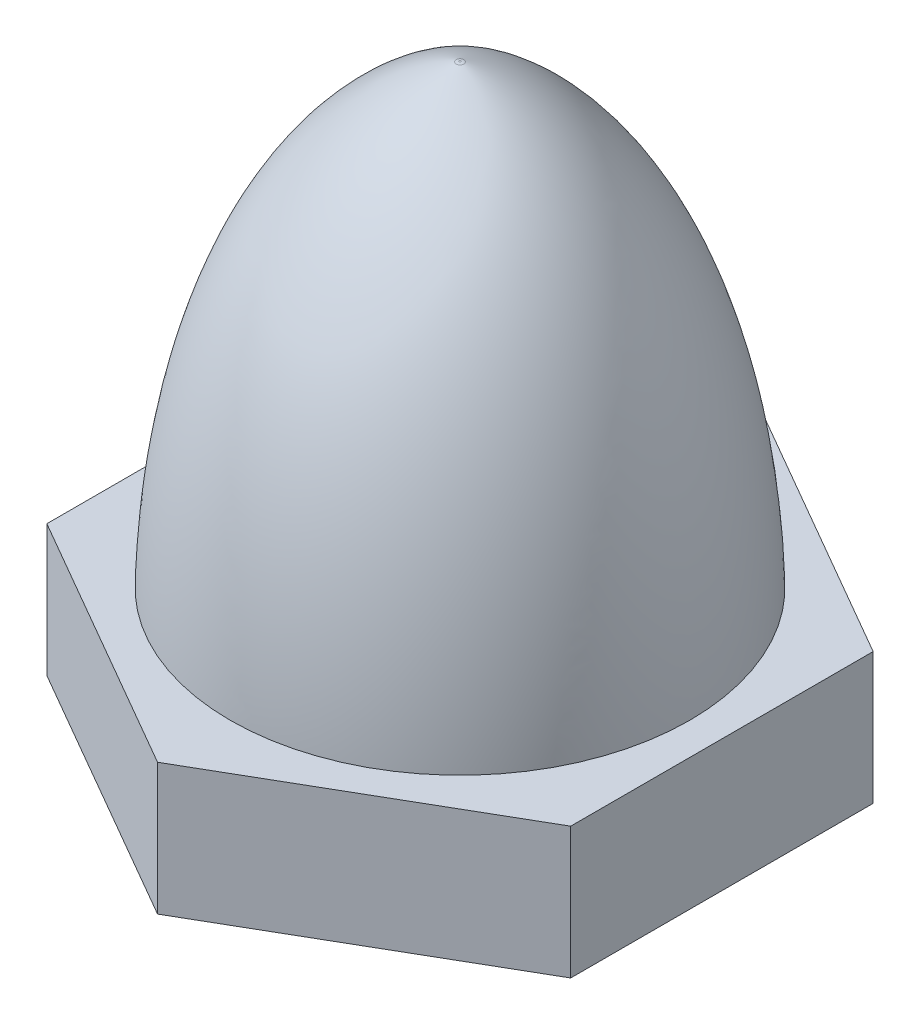
ISO-10303-21;
HEADER;
FILE_DESCRIPTION(('STEP AP214'),'2;1');
FILE_NAME('part.step','',(''),(''),'','','');
FILE_SCHEMA(('AUTOMOTIVE_DESIGN { 1 0 10303 214 1 1 1 1 }'));
ENDSEC;
DATA;
#1=APPLICATION_CONTEXT('core data for automotive mechanical design processes');
#2=APPLICATION_PROTOCOL_DEFINITION('international standard','automotive_design',2000,#1);
#3=PRODUCT_CONTEXT('',#1,'mechanical');
#4=PRODUCT('Part','Part','',(#3));
#5=PRODUCT_RELATED_PRODUCT_CATEGORY('part','',(#4));
#6=PRODUCT_DEFINITION_FORMATION('','',#4);
#7=PRODUCT_DEFINITION_CONTEXT('part definition',#1,'design');
#8=PRODUCT_DEFINITION('design','',#6,#7);
#9=PRODUCT_DEFINITION_SHAPE('','',#8);
#10=(LENGTH_UNIT() NAMED_UNIT(*) SI_UNIT(.MILLI.,.METRE.));
#11=(NAMED_UNIT(*) PLANE_ANGLE_UNIT() SI_UNIT($,.RADIAN.));
#12=(NAMED_UNIT(*) SI_UNIT($,.STERADIAN.) SOLID_ANGLE_UNIT());
#13=UNCERTAINTY_MEASURE_WITH_UNIT(LENGTH_MEASURE(1.E-05),#10,'distance_accuracy_value','');
#14=(GEOMETRIC_REPRESENTATION_CONTEXT(3) GLOBAL_UNCERTAINTY_ASSIGNED_CONTEXT((#13)) GLOBAL_UNIT_ASSIGNED_CONTEXT((#10,
#11,#12)) REPRESENTATION_CONTEXT('',''));
#15=CARTESIAN_POINT('',(0.,0.,0.));
#16=DIRECTION('',(0.,0.,1.));
#17=DIRECTION('',(1.,0.,0.));
#18=AXIS2_PLACEMENT_3D('',#15,#16,#17);
#19=CARTESIAN_POINT('',(-5.97557528611263,3.,3.45));
#20=DIRECTION('',(0.5,0.,-0.866025403784439));
#21=DIRECTION('',(-0.866025403784439,0.,-0.5));
#22=AXIS2_PLACEMENT_3D('',#19,#20,#21);
#23=PLANE('',#22);
#24=DIRECTION('',(0.866025403784439,0.,0.5));
#25=VECTOR('',#24,1.);
#26=CARTESIAN_POINT('',(-5.97557528611263,0.,3.45));
#27=LINE('',#26,#25);
#28=CARTESIAN_POINT('',(-5.97557528611263,0.,3.45));
#29=VERTEX_POINT('',#28);
#30=CARTESIAN_POINT('',(0.,0.,6.9));
#31=VERTEX_POINT('',#30);
#32=EDGE_CURVE('E126',#29,#31,#27,.T.);
#33=ORIENTED_EDGE('',*,*,#32,.T.);
#34=DIRECTION('',(0.,-1.,0.));
#35=VECTOR('',#34,1.);
#36=CARTESIAN_POINT('',(0.,3.,6.9));
#37=LINE('',#36,#35);
#38=CARTESIAN_POINT('',(0.,3.,6.9));
#39=VERTEX_POINT('',#38);
#40=EDGE_CURVE('E144',#39,#31,#37,.T.);
#41=ORIENTED_EDGE('',*,*,#40,.F.);
#42=DIRECTION('',(0.866025403784439,0.,0.5));
#43=VECTOR('',#42,1.);
#44=CARTESIAN_POINT('',(-5.97557528611263,3.,3.45));
#45=LINE('',#44,#43);
#46=CARTESIAN_POINT('',(-5.97557528611263,3.,3.45));
#47=VERTEX_POINT('',#46);
#48=EDGE_CURVE('E137',#47,#39,#45,.T.);
#49=ORIENTED_EDGE('',*,*,#48,.F.);
#50=DIRECTION('',(0.,-1.,0.));
#51=VECTOR('',#50,1.);
#52=CARTESIAN_POINT('',(-5.97557528611263,3.,3.45));
#53=LINE('',#52,#51);
#54=EDGE_CURVE('E122',#47,#29,#53,.T.);
#55=ORIENTED_EDGE('',*,*,#54,.T.);
#56=EDGE_LOOP('',(#33,#41,#49,#55));
#57=FACE_BOUND('',#56,.T.);
#58=ADVANCED_FACE('F39',(#57),#23,.F.);
#59=CARTESIAN_POINT('',(0.,3.,6.9));
#60=DIRECTION('',(-0.5,0.,-0.866025403784439));
#61=DIRECTION('',(-0.866025403784439,0.,0.5));
#62=AXIS2_PLACEMENT_3D('',#59,#60,#61);
#63=PLANE('',#62);
#64=DIRECTION('',(0.866025403784439,0.,-0.5));
#65=VECTOR('',#64,1.);
#66=CARTESIAN_POINT('',(0.,0.,6.9));
#67=LINE('',#66,#65);
#68=CARTESIAN_POINT('',(5.97557528611263,0.,3.45));
#69=VERTEX_POINT('',#68);
#70=EDGE_CURVE('E129',#31,#69,#67,.T.);
#71=ORIENTED_EDGE('',*,*,#70,.T.);
#72=DIRECTION('',(0.,-1.,0.));
#73=VECTOR('',#72,1.);
#74=CARTESIAN_POINT('',(5.97557528611263,3.,3.45));
#75=LINE('',#74,#73);
#76=CARTESIAN_POINT('',(5.97557528611263,3.,3.45));
#77=VERTEX_POINT('',#76);
#78=EDGE_CURVE('E141',#77,#69,#75,.T.);
#79=ORIENTED_EDGE('',*,*,#78,.F.);
#80=DIRECTION('',(0.866025403784439,0.,-0.5));
#81=VECTOR('',#80,1.);
#82=CARTESIAN_POINT('',(0.,3.,6.9));
#83=LINE('',#82,#81);
#84=EDGE_CURVE('E94',#39,#77,#83,.T.);
#85=ORIENTED_EDGE('',*,*,#84,.F.);
#86=ORIENTED_EDGE('',*,*,#40,.T.);
#87=EDGE_LOOP('',(#71,#79,#85,#86));
#88=FACE_BOUND('',#87,.T.);
#89=ADVANCED_FACE('F164',(#88),#63,.F.);
#90=CARTESIAN_POINT('',(5.97557528611263,3.,3.45));
#91=DIRECTION('',(-1.,0.,0.));
#92=DIRECTION('',(0.,0.,1.));
#93=AXIS2_PLACEMENT_3D('',#90,#91,#92);
#94=PLANE('',#93);
#95=DIRECTION('',(0.,0.,-1.));
#96=VECTOR('',#95,1.);
#97=CARTESIAN_POINT('',(5.97557528611263,0.,3.45));
#98=LINE('',#97,#96);
#99=CARTESIAN_POINT('',(5.97557528611262,0.,-3.45));
#100=VERTEX_POINT('',#99);
#101=EDGE_CURVE('E132',#69,#100,#98,.T.);
#102=ORIENTED_EDGE('',*,*,#101,.T.);
#103=DIRECTION('',(0.,-1.,0.));
#104=VECTOR('',#103,1.);
#105=CARTESIAN_POINT('',(5.97557528611262,3.,-3.45));
#106=LINE('',#105,#104);
#107=CARTESIAN_POINT('',(5.97557528611262,3.,-3.45));
#108=VERTEX_POINT('',#107);
#109=EDGE_CURVE('E117',#108,#100,#106,.T.);
#110=ORIENTED_EDGE('',*,*,#109,.F.);
#111=DIRECTION('',(0.,0.,-1.));
#112=VECTOR('',#111,1.);
#113=CARTESIAN_POINT('',(5.97557528611263,3.,3.45));
#114=LINE('',#113,#112);
#115=EDGE_CURVE('E108',#77,#108,#114,.T.);
#116=ORIENTED_EDGE('',*,*,#115,.F.);
#117=ORIENTED_EDGE('',*,*,#78,.T.);
#118=EDGE_LOOP('',(#102,#110,#116,#117));
#119=FACE_BOUND('',#118,.T.);
#120=ADVANCED_FACE('F169',(#119),#94,.F.);
#121=CARTESIAN_POINT('',(5.97557528611262,3.,-3.45));
#122=DIRECTION('',(-0.5,0.,0.866025403784439));
#123=DIRECTION('',(0.866025403784439,0.,0.5));
#124=AXIS2_PLACEMENT_3D('',#121,#122,#123);
#125=PLANE('',#124);
#126=DIRECTION('',(-0.866025403784439,0.,-0.5));
#127=VECTOR('',#126,1.);
#128=CARTESIAN_POINT('',(5.97557528611262,0.,-3.45));
#129=LINE('',#128,#127);
#130=CARTESIAN_POINT('',(0.,0.,-6.9));
#131=VERTEX_POINT('',#130);
#132=EDGE_CURVE('E116',#100,#131,#129,.T.);
#133=ORIENTED_EDGE('',*,*,#132,.T.);
#134=DIRECTION('',(0.,-1.,0.));
#135=VECTOR('',#134,1.);
#136=CARTESIAN_POINT('',(0.,3.,-6.9));
#137=LINE('',#136,#135);
#138=CARTESIAN_POINT('',(0.,3.,-6.9));
#139=VERTEX_POINT('',#138);
#140=EDGE_CURVE('E113',#139,#131,#137,.T.);
#141=ORIENTED_EDGE('',*,*,#140,.F.);
#142=DIRECTION('',(-0.866025403784439,0.,-0.5));
#143=VECTOR('',#142,1.);
#144=CARTESIAN_POINT('',(5.97557528611262,3.,-3.45));
#145=LINE('',#144,#143);
#146=EDGE_CURVE('E101',#108,#139,#145,.T.);
#147=ORIENTED_EDGE('',*,*,#146,.F.);
#148=ORIENTED_EDGE('',*,*,#109,.T.);
#149=EDGE_LOOP('',(#133,#141,#147,#148));
#150=FACE_BOUND('',#149,.T.);
#151=ADVANCED_FACE('F114',(#150),#125,.F.);
#152=CARTESIAN_POINT('',(0.,3.,-6.9));
#153=DIRECTION('',(0.5,0.,0.866025403784439));
#154=DIRECTION('',(0.866025403784439,0.,-0.5));
#155=AXIS2_PLACEMENT_3D('',#152,#153,#154);
#156=PLANE('',#155);
#157=DIRECTION('',(-0.866025403784439,0.,0.5));
#158=VECTOR('',#157,1.);
#159=CARTESIAN_POINT('',(0.,0.,-6.9));
#160=LINE('',#159,#158);
#161=CARTESIAN_POINT('',(-5.97557528611263,0.,-3.45));
#162=VERTEX_POINT('',#161);
#163=EDGE_CURVE('E79',#131,#162,#160,.T.);
#164=ORIENTED_EDGE('',*,*,#163,.T.);
#165=DIRECTION('',(0.,-1.,0.));
#166=VECTOR('',#165,1.);
#167=CARTESIAN_POINT('',(-5.97557528611263,3.,-3.45));
#168=LINE('',#167,#166);
#169=CARTESIAN_POINT('',(-5.97557528611263,3.,-3.45));
#170=VERTEX_POINT('',#169);
#171=EDGE_CURVE('E118',#170,#162,#168,.T.);
#172=ORIENTED_EDGE('',*,*,#171,.F.);
#173=DIRECTION('',(-0.866025403784439,0.,0.5));
#174=VECTOR('',#173,1.);
#175=CARTESIAN_POINT('',(0.,3.,-6.9));
#176=LINE('',#175,#174);
#177=EDGE_CURVE('E106',#139,#170,#176,.T.);
#178=ORIENTED_EDGE('',*,*,#177,.F.);
#179=ORIENTED_EDGE('',*,*,#140,.T.);
#180=EDGE_LOOP('',(#164,#172,#178,#179));
#181=FACE_BOUND('',#180,.T.);
#182=ADVANCED_FACE('F120',(#181),#156,.F.);
#183=CARTESIAN_POINT('',(-5.97557528611263,3.,-3.45));
#184=DIRECTION('',(1.,0.,0.));
#185=DIRECTION('',(0.,0.,-1.));
#186=AXIS2_PLACEMENT_3D('',#183,#184,#185);
#187=PLANE('',#186);
#188=DIRECTION('',(0.,0.,1.));
#189=VECTOR('',#188,1.);
#190=CARTESIAN_POINT('',(-5.97557528611263,0.,-3.45));
#191=LINE('',#190,#189);
#192=EDGE_CURVE('E85',#162,#29,#191,.T.);
#193=ORIENTED_EDGE('',*,*,#192,.T.);
#194=ORIENTED_EDGE('',*,*,#54,.F.);
#195=DIRECTION('',(0.,0.,1.));
#196=VECTOR('',#195,1.);
#197=CARTESIAN_POINT('',(-5.97557528611263,3.,-3.45));
#198=LINE('',#197,#196);
#199=EDGE_CURVE('E56',#170,#47,#198,.T.);
#200=ORIENTED_EDGE('',*,*,#199,.F.);
#201=ORIENTED_EDGE('',*,*,#171,.T.);
#202=EDGE_LOOP('',(#193,#194,#200,#201));
#203=FACE_BOUND('',#202,.T.);
#204=ADVANCED_FACE('F179',(#203),#187,.F.);
#205=CARTESIAN_POINT('',(0.,3.,0.));
#206=DIRECTION('',(0.,1.,0.));
#207=DIRECTION('',(0.,0.,1.));
#208=AXIS2_PLACEMENT_3D('',#205,#206,#207);
#209=PLANE('',#208);
#210=ORIENTED_EDGE('',*,*,#48,.T.);
#211=ORIENTED_EDGE('',*,*,#84,.T.);
#212=ORIENTED_EDGE('',*,*,#115,.T.);
#213=ORIENTED_EDGE('',*,*,#146,.T.);
#214=ORIENTED_EDGE('',*,*,#177,.T.);
#215=ORIENTED_EDGE('',*,*,#199,.T.);
#216=EDGE_LOOP('',(#210,#211,#212,#213,#214,#215));
#217=FACE_BOUND('',#216,.T.);
#218=CARTESIAN_POINT('',(0.,2.99999999999998,0.));
#219=DIRECTION('',(0.,1.,0.));
#220=DIRECTION('',(-1.,0.,0.));
#221=AXIS2_PLACEMENT_3D('',#218,#219,#220);
#222=CIRCLE('',#221,5.24277599733097);
#223=CARTESIAN_POINT('',(-5.24277599733097,2.99999999999998,0.));
#224=VERTEX_POINT('',#223);
#225=EDGE_CURVE('E130',#224,#224,#222,.T.);
#226=ORIENTED_EDGE('',*,*,#225,.F.);
#227=EDGE_LOOP('',(#226));
#228=FACE_BOUND('',#227,.T.);
#229=ADVANCED_FACE('F103',(#217,#228),#209,.T.);
#230=CARTESIAN_POINT('',(0.,0.,0.));
#231=DIRECTION('',(0.,1.,0.));
#232=DIRECTION('',(0.,0.,1.));
#233=AXIS2_PLACEMENT_3D('',#230,#231,#232);
#234=PLANE('',#233);
#235=CARTESIAN_POINT('',(0.,0.,0.));
#236=DIRECTION('',(0.,-1.,0.));
#237=DIRECTION('',(0.,0.,-1.));
#238=AXIS2_PLACEMENT_3D('',#235,#236,#237);
#239=CIRCLE('',#238,2.5);
#240=CARTESIAN_POINT('',(0.,0.,-2.5));
#241=VERTEX_POINT('',#240);
#242=EDGE_CURVE('E197',#241,#241,#239,.T.);
#243=ORIENTED_EDGE('',*,*,#242,.F.);
#244=EDGE_LOOP('',(#243));
#245=FACE_BOUND('',#244,.T.);
#246=ORIENTED_EDGE('',*,*,#32,.F.);
#247=ORIENTED_EDGE('',*,*,#192,.F.);
#248=ORIENTED_EDGE('',*,*,#163,.F.);
#249=ORIENTED_EDGE('',*,*,#132,.F.);
#250=ORIENTED_EDGE('',*,*,#101,.F.);
#251=ORIENTED_EDGE('',*,*,#70,.F.);
#252=EDGE_LOOP('',(#246,#247,#248,#249,#250,#251));
#253=FACE_BOUND('',#252,.T.);
#254=ADVANCED_FACE('F182',(#245,#253),#234,.F.);
#255=CARTESIAN_POINT('',(-4.54037720003992,2.99999999999998,-2.62138799866549));
#256=CARTESIAN_POINT('',(-4.44219244943973,7.59175773734786,-2.56470100647615));
#257=CARTESIAN_POINT('',(-3.07699381909672,12.1955421831902,-1.7765032097503));
#258=CARTESIAN_POINT('',(-0.0476774095603031,13.4,-0.027526565243905));
#259=B_SPLINE_CURVE_WITH_KNOTS('',3,(#255,#256,#257,#258),.UNSPECIFIED.,.F.,.F.,(4,4),
(0.00343086740114662,0.878426723997923),.UNSPECIFIED.);
#260=CARTESIAN_POINT('',(0.,16.4,0.));
#261=DIRECTION('',(0.,1.,0.));
#262=AXIS1_PLACEMENT('',#260,#261);
#263=SURFACE_OF_REVOLUTION('',#259,#262);
#264=CARTESIAN_POINT('',(0.,13.388679827312,0.));
#265=DIRECTION('',(0.,1.,0.));
#266=DIRECTION('',(-1.,0.,0.));
#267=AXIS2_PLACEMENT_3D('',#264,#265,#266);
#268=CIRCLE('',#267,0.0875879174464675);
#269=CARTESIAN_POINT('',(-0.0875879174464675,13.388679827312,0.));
#270=VERTEX_POINT('',#269);
#271=EDGE_CURVE('E11',#270,#270,#268,.F.);
#272=ORIENTED_EDGE('',*,*,#271,.T.);
#273=EDGE_LOOP('',(#272));
#274=FACE_BOUND('',#273,.T.);
#275=ORIENTED_EDGE('',*,*,#225,.T.);
#276=EDGE_LOOP('',(#275));
#277=FACE_BOUND('',#276,.T.);
#278=ADVANCED_FACE('F160',(#274,#277),#263,.T.);
#279=CARTESIAN_POINT('',(0.,13.4,0.));
#280=DIRECTION('',(0.,1.,0.));
#281=DIRECTION('',(0.,0.,1.));
#282=AXIS2_PLACEMENT_3D('',#279,#280,#281);
#283=PLANE('',#282);
#284=CARTESIAN_POINT('',(0.,13.4,0.));
#285=DIRECTION('',(0.,1.,0.));
#286=DIRECTION('',(0.,0.,1.));
#287=AXIS2_PLACEMENT_3D('',#284,#285,#286);
#288=CIRCLE('',#287,0.0212560038186873);
#289=CARTESIAN_POINT('',(0.,13.4,0.0212560038186873));
#290=VERTEX_POINT('',#289);
#291=EDGE_CURVE('E48',#290,#290,#288,.T.);
#292=ORIENTED_EDGE('',*,*,#291,.T.);
#293=EDGE_LOOP('',(#292));
#294=FACE_BOUND('',#293,.T.);
#295=ADVANCED_FACE('F148',(#294),#283,.T.);
#296=CARTESIAN_POINT('',(0.,13.2,0.));
#297=DIRECTION('',(0.,1.,0.));
#298=DIRECTION('',(-1.,0.,0.));
#299=AXIS2_PLACEMENT_3D('',#296,#297,#298);
#300=DEGENERATE_TOROIDAL_SURFACE('',#299,0.0212560038186873,0.2,.T.);
#301=ORIENTED_EDGE('',*,*,#271,.F.);
#302=EDGE_LOOP('',(#301));
#303=FACE_BOUND('',#302,.T.);
#304=ORIENTED_EDGE('',*,*,#291,.F.);
#305=EDGE_LOOP('',(#304));
#306=FACE_BOUND('',#305,.T.);
#307=ADVANCED_FACE('F41',(#303,#306),#300,.T.);
#308=CARTESIAN_POINT('',(0.,10.,0.));
#309=DIRECTION('',(0.,-1.,0.));
#310=DIRECTION('',(0.,0.,-1.));
#311=AXIS2_PLACEMENT_3D('',#308,#309,#310);
#312=CYLINDRICAL_SURFACE('',#311,2.5);
#313=CARTESIAN_POINT('',(0.,10.,0.));
#314=DIRECTION('',(0.,-1.,0.));
#315=DIRECTION('',(0.,0.,-1.));
#316=AXIS2_PLACEMENT_3D('',#313,#314,#315);
#317=CIRCLE('',#316,2.5);
#318=CARTESIAN_POINT('',(0.,10.,-2.5));
#319=VERTEX_POINT('',#318);
#320=EDGE_CURVE('E204',#319,#319,#317,.T.);
#321=ORIENTED_EDGE('',*,*,#320,.F.);
#322=EDGE_LOOP('',(#321));
#323=FACE_BOUND('',#322,.T.);
#324=ORIENTED_EDGE('',*,*,#242,.T.);
#325=EDGE_LOOP('',(#324));
#326=FACE_BOUND('',#325,.T.);
#327=ADVANCED_FACE('F151',(#323,#326),#312,.F.);
#328=CARTESIAN_POINT('',(0.,10.,0.));
#329=DIRECTION('',(0.,-1.,0.));
#330=DIRECTION('',(0.,0.,-1.));
#331=AXIS2_PLACEMENT_3D('',#328,#329,#330);
#332=PLANE('',#331);
#333=ORIENTED_EDGE('',*,*,#320,.T.);
#334=EDGE_LOOP('',(#333));
#335=FACE_BOUND('',#334,.T.);
#336=ADVANCED_FACE('F157',(#335),#332,.T.);
#337=CLOSED_SHELL('',(#58,#89,#120,#151,#182,#204,#229,#254,#278,#295,#307,#327,#336));
#338=MANIFOLD_SOLID_BREP('B2',#337);
#339=ADVANCED_BREP_SHAPE_REPRESENTATION('',(#18,#338),#14);
#340=SHAPE_DEFINITION_REPRESENTATION(#9,#339);
ENDSEC;
END-ISO-10303-21;
